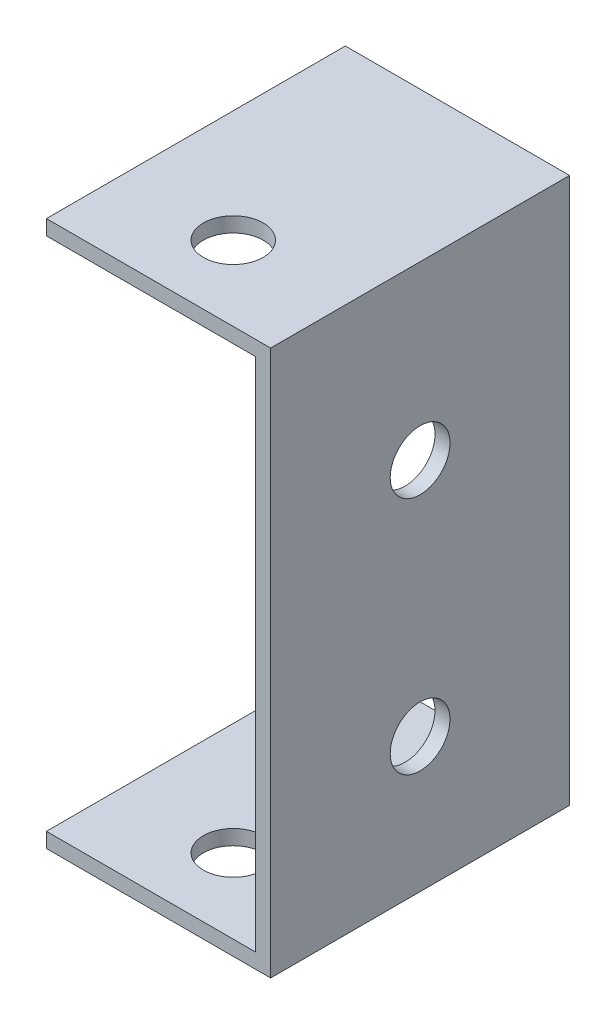
ISO-10303-21;
HEADER;
FILE_DESCRIPTION(('STEP AP214'),'2;1');
FILE_NAME('part.step','',(''),(''),'','','');
FILE_SCHEMA(('AUTOMOTIVE_DESIGN { 1 0 10303 214 1 1 1 1 }'));
ENDSEC;
DATA;
#1=APPLICATION_CONTEXT('core data for automotive mechanical design processes');
#2=APPLICATION_PROTOCOL_DEFINITION('international standard','automotive_design',2000,#1);
#3=PRODUCT_CONTEXT('',#1,'mechanical');
#4=PRODUCT('Part','Part','',(#3));
#5=PRODUCT_RELATED_PRODUCT_CATEGORY('part','',(#4));
#6=PRODUCT_DEFINITION_FORMATION('','',#4);
#7=PRODUCT_DEFINITION_CONTEXT('part definition',#1,'design');
#8=PRODUCT_DEFINITION('design','',#6,#7);
#9=PRODUCT_DEFINITION_SHAPE('','',#8);
#10=(LENGTH_UNIT() NAMED_UNIT(*) SI_UNIT(.MILLI.,.METRE.));
#11=(NAMED_UNIT(*) PLANE_ANGLE_UNIT() SI_UNIT($,.RADIAN.));
#12=(NAMED_UNIT(*) SI_UNIT($,.STERADIAN.) SOLID_ANGLE_UNIT());
#13=UNCERTAINTY_MEASURE_WITH_UNIT(LENGTH_MEASURE(1.E-05),#10,'distance_accuracy_value','');
#14=(GEOMETRIC_REPRESENTATION_CONTEXT(3) GLOBAL_UNCERTAINTY_ASSIGNED_CONTEXT((#13)) GLOBAL_UNIT_ASSIGNED_CONTEXT((#10,
#11,#12)) REPRESENTATION_CONTEXT('',''));
#15=CARTESIAN_POINT('',(0.,0.,0.));
#16=DIRECTION('',(0.,0.,1.));
#17=DIRECTION('',(1.,0.,0.));
#18=AXIS2_PLACEMENT_3D('',#15,#16,#17);
#19=CARTESIAN_POINT('',(-61.1657608940353,44.9950245879445,40.));
#20=DIRECTION('',(1.,0.,0.));
#21=DIRECTION('',(0.,0.,-1.));
#22=AXIS2_PLACEMENT_3D('',#19,#20,#21);
#23=PLANE('',#22);
#24=DIRECTION('',(0.,-1.,0.));
#25=VECTOR('',#24,1.);
#26=CARTESIAN_POINT('',(-61.1657608940353,44.9950245879445,0.));
#27=LINE('',#26,#25);
#28=CARTESIAN_POINT('',(-61.1657608940353,46.9950245879445,0.));
#29=VERTEX_POINT('',#28);
#30=CARTESIAN_POINT('',(-61.1657608940353,44.9950245879445,0.));
#31=VERTEX_POINT('',#30);
#32=EDGE_CURVE('E145',#29,#31,#27,.T.);
#33=ORIENTED_EDGE('',*,*,#32,.T.);
#34=DIRECTION('',(0.,0.,-1.));
#35=VECTOR('',#34,1.);
#36=CARTESIAN_POINT('',(-61.1657608940353,44.9950245879445,40.));
#37=LINE('',#36,#35);
#38=CARTESIAN_POINT('',(-61.1657608940353,44.9950245879445,40.));
#39=VERTEX_POINT('',#38);
#40=EDGE_CURVE('E13',#39,#31,#37,.T.);
#41=ORIENTED_EDGE('',*,*,#40,.F.);
#42=DIRECTION('',(0.,-1.,0.));
#43=VECTOR('',#42,1.);
#44=CARTESIAN_POINT('',(-61.1657608940353,44.9950245879445,40.));
#45=LINE('',#44,#43);
#46=CARTESIAN_POINT('',(-61.1657608940353,46.9950245879445,40.));
#47=VERTEX_POINT('',#46);
#48=EDGE_CURVE('E159',#47,#39,#45,.T.);
#49=ORIENTED_EDGE('',*,*,#48,.F.);
#50=DIRECTION('',(0.,0.,-1.));
#51=VECTOR('',#50,1.);
#52=CARTESIAN_POINT('',(-61.1657608940353,46.9950245879445,40.));
#53=LINE('',#52,#51);
#54=EDGE_CURVE('E141',#47,#29,#53,.T.);
#55=ORIENTED_EDGE('',*,*,#54,.T.);
#56=EDGE_LOOP('',(#33,#41,#49,#55));
#57=FACE_BOUND('',#56,.T.);
#58=ADVANCED_FACE('F47',(#57),#23,.F.);
#59=CARTESIAN_POINT('',(-33.1657608940353,44.9950245879445,40.));
#60=DIRECTION('',(0.,1.,0.));
#61=DIRECTION('',(0.,0.,1.));
#62=AXIS2_PLACEMENT_3D('',#59,#60,#61);
#63=PLANE('',#62);
#64=CARTESIAN_POINT('',(-46.1657608940353,44.9950245879445,30.));
#65=DIRECTION('',(0.,1.,0.));
#66=DIRECTION('',(0.,0.,1.));
#67=AXIS2_PLACEMENT_3D('',#64,#65,#66);
#68=CIRCLE('',#67,4.);
#69=CARTESIAN_POINT('',(-46.1657608940353,44.9950245879445,34.));
#70=VERTEX_POINT('',#69);
#71=EDGE_CURVE('E182',#70,#70,#68,.T.);
#72=ORIENTED_EDGE('',*,*,#71,.T.);
#73=EDGE_LOOP('',(#72));
#74=FACE_BOUND('',#73,.T.);
#75=DIRECTION('',(1.,0.,0.));
#76=VECTOR('',#75,1.);
#77=CARTESIAN_POINT('',(-33.1657608940353,44.9950245879445,0.));
#78=LINE('',#77,#76);
#79=CARTESIAN_POINT('',(-33.1657608940353,44.9950245879445,0.));
#80=VERTEX_POINT('',#79);
#81=EDGE_CURVE('E148',#31,#80,#78,.T.);
#82=ORIENTED_EDGE('',*,*,#81,.T.);
#83=DIRECTION('',(0.,0.,-1.));
#84=VECTOR('',#83,1.);
#85=CARTESIAN_POINT('',(-33.1657608940353,44.9950245879445,40.));
#86=LINE('',#85,#84);
#87=CARTESIAN_POINT('',(-33.1657608940353,44.9950245879445,40.));
#88=VERTEX_POINT('',#87);
#89=EDGE_CURVE('E56',#88,#80,#86,.T.);
#90=ORIENTED_EDGE('',*,*,#89,.F.);
#91=DIRECTION('',(1.,0.,0.));
#92=VECTOR('',#91,1.);
#93=CARTESIAN_POINT('',(-33.1657608940353,44.9950245879445,40.));
#94=LINE('',#93,#92);
#95=EDGE_CURVE('E108',#39,#88,#94,.T.);
#96=ORIENTED_EDGE('',*,*,#95,.F.);
#97=ORIENTED_EDGE('',*,*,#40,.T.);
#98=EDGE_LOOP('',(#82,#90,#96,#97));
#99=FACE_BOUND('',#98,.T.);
#100=ADVANCED_FACE('F223',(#74,#99),#63,.F.);
#101=CARTESIAN_POINT('',(-33.1657608940353,-24.0049754120555,40.));
#102=DIRECTION('',(1.,0.,0.));
#103=DIRECTION('',(0.,0.,-1.));
#104=AXIS2_PLACEMENT_3D('',#101,#102,#103);
#105=PLANE('',#104);
#106=CARTESIAN_POINT('',(-33.1657608940353,23.9950245879445,20.));
#107=DIRECTION('',(-1.,0.,0.));
#108=DIRECTION('',(0.,0.,1.));
#109=AXIS2_PLACEMENT_3D('',#106,#107,#108);
#110=CIRCLE('',#109,4.);
#111=CARTESIAN_POINT('',(-33.1657608940353,23.9950245879445,24.));
#112=VERTEX_POINT('',#111);
#113=EDGE_CURVE('E172',#112,#112,#110,.T.);
#114=ORIENTED_EDGE('',*,*,#113,.F.);
#115=EDGE_LOOP('',(#114));
#116=FACE_BOUND('',#115,.T.);
#117=CARTESIAN_POINT('',(-33.1657608940353,-8.00497541205545,20.));
#118=DIRECTION('',(-1.,0.,0.));
#119=DIRECTION('',(0.,0.,1.));
#120=AXIS2_PLACEMENT_3D('',#117,#118,#119);
#121=CIRCLE('',#120,4.);
#122=CARTESIAN_POINT('',(-33.1657608940353,-8.00497541205545,24.));
#123=VERTEX_POINT('',#122);
#124=EDGE_CURVE('E177',#123,#123,#121,.T.);
#125=ORIENTED_EDGE('',*,*,#124,.F.);
#126=EDGE_LOOP('',(#125));
#127=FACE_BOUND('',#126,.T.);
#128=DIRECTION('',(0.,-1.,0.));
#129=VECTOR('',#128,1.);
#130=CARTESIAN_POINT('',(-33.1657608940353,-24.0049754120555,0.));
#131=LINE('',#130,#129);
#132=CARTESIAN_POINT('',(-33.1657608940353,-24.0049754120555,0.));
#133=VERTEX_POINT('',#132);
#134=EDGE_CURVE('E150',#80,#133,#131,.T.);
#135=ORIENTED_EDGE('',*,*,#134,.T.);
#136=DIRECTION('',(0.,0.,-1.));
#137=VECTOR('',#136,1.);
#138=CARTESIAN_POINT('',(-33.1657608940353,-24.0049754120555,40.));
#139=LINE('',#138,#137);
#140=CARTESIAN_POINT('',(-33.1657608940353,-24.0049754120555,40.));
#141=VERTEX_POINT('',#140);
#142=EDGE_CURVE('E166',#141,#133,#139,.T.);
#143=ORIENTED_EDGE('',*,*,#142,.F.);
#144=DIRECTION('',(0.,-1.,0.));
#145=VECTOR('',#144,1.);
#146=CARTESIAN_POINT('',(-33.1657608940353,-24.0049754120555,40.));
#147=LINE('',#146,#145);
#148=EDGE_CURVE('E189',#88,#141,#147,.T.);
#149=ORIENTED_EDGE('',*,*,#148,.F.);
#150=ORIENTED_EDGE('',*,*,#89,.T.);
#151=EDGE_LOOP('',(#135,#143,#149,#150));
#152=FACE_BOUND('',#151,.T.);
#153=ADVANCED_FACE('F227',(#116,#127,#152),#105,.F.);
#154=CARTESIAN_POINT('',(-61.1657608940353,-24.0049754120555,40.));
#155=DIRECTION('',(0.,-1.,0.));
#156=DIRECTION('',(0.,0.,-1.));
#157=AXIS2_PLACEMENT_3D('',#154,#155,#156);
#158=PLANE('',#157);
#159=CARTESIAN_POINT('',(-46.1657608940353,-24.0049754120555,30.));
#160=DIRECTION('',(0.,-1.,0.));
#161=DIRECTION('',(0.,0.,-1.));
#162=AXIS2_PLACEMENT_3D('',#159,#160,#161);
#163=CIRCLE('',#162,4.);
#164=CARTESIAN_POINT('',(-46.1657608940353,-24.0049754120555,26.));
#165=VERTEX_POINT('',#164);
#166=EDGE_CURVE('E249',#165,#165,#163,.T.);
#167=ORIENTED_EDGE('',*,*,#166,.T.);
#168=EDGE_LOOP('',(#167));
#169=FACE_BOUND('',#168,.T.);
#170=DIRECTION('',(-1.,0.,0.));
#171=VECTOR('',#170,1.);
#172=CARTESIAN_POINT('',(-61.1657608940353,-24.0049754120555,0.));
#173=LINE('',#172,#171);
#174=CARTESIAN_POINT('',(-61.1657608940353,-24.0049754120555,0.));
#175=VERTEX_POINT('',#174);
#176=EDGE_CURVE('E152',#133,#175,#173,.T.);
#177=ORIENTED_EDGE('',*,*,#176,.T.);
#178=DIRECTION('',(0.,0.,-1.));
#179=VECTOR('',#178,1.);
#180=CARTESIAN_POINT('',(-61.1657608940353,-24.0049754120555,40.));
#181=LINE('',#180,#179);
#182=CARTESIAN_POINT('',(-61.1657608940353,-24.0049754120555,40.));
#183=VERTEX_POINT('',#182);
#184=EDGE_CURVE('E163',#183,#175,#181,.T.);
#185=ORIENTED_EDGE('',*,*,#184,.F.);
#186=DIRECTION('',(-1.,0.,0.));
#187=VECTOR('',#186,1.);
#188=CARTESIAN_POINT('',(-61.1657608940353,-24.0049754120555,40.));
#189=LINE('',#188,#187);
#190=EDGE_CURVE('E191',#141,#183,#189,.T.);
#191=ORIENTED_EDGE('',*,*,#190,.F.);
#192=ORIENTED_EDGE('',*,*,#142,.T.);
#193=EDGE_LOOP('',(#177,#185,#191,#192));
#194=FACE_BOUND('',#193,.T.);
#195=ADVANCED_FACE('F197',(#169,#194),#158,.F.);
#196=CARTESIAN_POINT('',(-61.1657608940353,-26.0049754120555,40.));
#197=DIRECTION('',(1.,0.,0.));
#198=DIRECTION('',(0.,0.,-1.));
#199=AXIS2_PLACEMENT_3D('',#196,#197,#198);
#200=PLANE('',#199);
#201=DIRECTION('',(0.,-1.,0.));
#202=VECTOR('',#201,1.);
#203=CARTESIAN_POINT('',(-61.1657608940353,-26.0049754120555,0.));
#204=LINE('',#203,#202);
#205=CARTESIAN_POINT('',(-61.1657608940353,-26.0049754120555,0.));
#206=VERTEX_POINT('',#205);
#207=EDGE_CURVE('E154',#175,#206,#204,.T.);
#208=ORIENTED_EDGE('',*,*,#207,.T.);
#209=DIRECTION('',(0.,0.,-1.));
#210=VECTOR('',#209,1.);
#211=CARTESIAN_POINT('',(-61.1657608940353,-26.0049754120555,40.));
#212=LINE('',#211,#210);
#213=CARTESIAN_POINT('',(-61.1657608940353,-26.0049754120555,40.));
#214=VERTEX_POINT('',#213);
#215=EDGE_CURVE('E136',#214,#206,#212,.T.);
#216=ORIENTED_EDGE('',*,*,#215,.F.);
#217=DIRECTION('',(0.,-1.,0.));
#218=VECTOR('',#217,1.);
#219=CARTESIAN_POINT('',(-61.1657608940353,-26.0049754120555,40.));
#220=LINE('',#219,#218);
#221=EDGE_CURVE('E127',#183,#214,#220,.T.);
#222=ORIENTED_EDGE('',*,*,#221,.F.);
#223=ORIENTED_EDGE('',*,*,#184,.T.);
#224=EDGE_LOOP('',(#208,#216,#222,#223));
#225=FACE_BOUND('',#224,.T.);
#226=ADVANCED_FACE('F201',(#225),#200,.F.);
#227=CARTESIAN_POINT('',(-31.1657608940353,-26.0049754120555,40.));
#228=DIRECTION('',(0.,1.,0.));
#229=DIRECTION('',(0.,0.,1.));
#230=AXIS2_PLACEMENT_3D('',#227,#228,#229);
#231=PLANE('',#230);
#232=CARTESIAN_POINT('',(-46.1657608940353,-26.0049754120555,30.));
#233=DIRECTION('',(0.,1.,0.));
#234=DIRECTION('',(0.,0.,1.));
#235=AXIS2_PLACEMENT_3D('',#232,#233,#234);
#236=CIRCLE('',#235,4.);
#237=CARTESIAN_POINT('',(-46.1657608940353,-26.0049754120555,34.));
#238=VERTEX_POINT('',#237);
#239=EDGE_CURVE('E247',#238,#238,#236,.T.);
#240=ORIENTED_EDGE('',*,*,#239,.T.);
#241=EDGE_LOOP('',(#240));
#242=FACE_BOUND('',#241,.T.);
#243=DIRECTION('',(1.,0.,0.));
#244=VECTOR('',#243,1.);
#245=CARTESIAN_POINT('',(-31.1657608940353,-26.0049754120555,0.));
#246=LINE('',#245,#244);
#247=CARTESIAN_POINT('',(-31.1657608940353,-26.0049754120555,0.));
#248=VERTEX_POINT('',#247);
#249=EDGE_CURVE('E135',#206,#248,#246,.T.);
#250=ORIENTED_EDGE('',*,*,#249,.T.);
#251=DIRECTION('',(0.,0.,-1.));
#252=VECTOR('',#251,1.);
#253=CARTESIAN_POINT('',(-31.1657608940353,-26.0049754120555,40.));
#254=LINE('',#253,#252);
#255=CARTESIAN_POINT('',(-31.1657608940353,-26.0049754120555,40.));
#256=VERTEX_POINT('',#255);
#257=EDGE_CURVE('E132',#256,#248,#254,.T.);
#258=ORIENTED_EDGE('',*,*,#257,.F.);
#259=DIRECTION('',(1.,0.,0.));
#260=VECTOR('',#259,1.);
#261=CARTESIAN_POINT('',(-31.1657608940353,-26.0049754120555,40.));
#262=LINE('',#261,#260);
#263=EDGE_CURVE('E121',#214,#256,#262,.T.);
#264=ORIENTED_EDGE('',*,*,#263,.F.);
#265=ORIENTED_EDGE('',*,*,#215,.T.);
#266=EDGE_LOOP('',(#250,#258,#264,#265));
#267=FACE_BOUND('',#266,.T.);
#268=ADVANCED_FACE('F133',(#242,#267),#231,.F.);
#269=CARTESIAN_POINT('',(-31.1657608940353,46.9950245879445,40.));
#270=DIRECTION('',(-1.,0.,0.));
#271=DIRECTION('',(0.,-1.,0.));
#272=AXIS2_PLACEMENT_3D('',#269,#270,#271);
#273=PLANE('',#272);
#274=CARTESIAN_POINT('',(-31.1657608940353,23.9950245879445,20.));
#275=DIRECTION('',(-1.,0.,0.));
#276=DIRECTION('',(0.,-1.,0.));
#277=AXIS2_PLACEMENT_3D('',#274,#275,#276);
#278=CIRCLE('',#277,4.);
#279=CARTESIAN_POINT('',(-31.1657608940353,19.9950245879445,20.));
#280=VERTEX_POINT('',#279);
#281=EDGE_CURVE('E50',#280,#280,#278,.T.);
#282=ORIENTED_EDGE('',*,*,#281,.T.);
#283=EDGE_LOOP('',(#282));
#284=FACE_BOUND('',#283,.T.);
#285=CARTESIAN_POINT('',(-31.1657608940353,-8.00497541205545,20.));
#286=DIRECTION('',(-1.,0.,0.));
#287=DIRECTION('',(0.,-1.,0.));
#288=AXIS2_PLACEMENT_3D('',#285,#286,#287);
#289=CIRCLE('',#288,4.);
#290=CARTESIAN_POINT('',(-31.1657608940353,-12.0049754120555,20.));
#291=VERTEX_POINT('',#290);
#292=EDGE_CURVE('E170',#291,#291,#289,.T.);
#293=ORIENTED_EDGE('',*,*,#292,.T.);
#294=EDGE_LOOP('',(#293));
#295=FACE_BOUND('',#294,.T.);
#296=DIRECTION('',(0.,1.,0.));
#297=VECTOR('',#296,1.);
#298=CARTESIAN_POINT('',(-31.1657608940353,46.9950245879445,0.));
#299=LINE('',#298,#297);
#300=CARTESIAN_POINT('',(-31.1657608940353,46.9950245879445,0.));
#301=VERTEX_POINT('',#300);
#302=EDGE_CURVE('E94',#248,#301,#299,.T.);
#303=ORIENTED_EDGE('',*,*,#302,.T.);
#304=DIRECTION('',(0.,0.,-1.));
#305=VECTOR('',#304,1.);
#306=CARTESIAN_POINT('',(-31.1657608940353,46.9950245879445,40.));
#307=LINE('',#306,#305);
#308=CARTESIAN_POINT('',(-31.1657608940353,46.9950245879445,40.));
#309=VERTEX_POINT('',#308);
#310=EDGE_CURVE('E137',#309,#301,#307,.T.);
#311=ORIENTED_EDGE('',*,*,#310,.F.);
#312=DIRECTION('',(0.,1.,0.));
#313=VECTOR('',#312,1.);
#314=CARTESIAN_POINT('',(-31.1657608940353,46.9950245879445,40.));
#315=LINE('',#314,#313);
#316=EDGE_CURVE('E125',#256,#309,#315,.T.);
#317=ORIENTED_EDGE('',*,*,#316,.F.);
#318=ORIENTED_EDGE('',*,*,#257,.T.);
#319=EDGE_LOOP('',(#303,#311,#317,#318));
#320=FACE_BOUND('',#319,.T.);
#321=ADVANCED_FACE('F139',(#284,#295,#320),#273,.F.);
#322=CARTESIAN_POINT('',(-61.1657608940353,46.9950245879445,40.));
#323=DIRECTION('',(0.,-1.,0.));
#324=DIRECTION('',(0.,0.,-1.));
#325=AXIS2_PLACEMENT_3D('',#322,#323,#324);
#326=PLANE('',#325);
#327=CARTESIAN_POINT('',(-46.1657608940353,46.9950245879445,30.));
#328=DIRECTION('',(0.,1.,0.));
#329=DIRECTION('',(0.,0.,1.));
#330=AXIS2_PLACEMENT_3D('',#327,#328,#329);
#331=CIRCLE('',#330,4.);
#332=CARTESIAN_POINT('',(-46.1657608940353,46.9950245879445,34.));
#333=VERTEX_POINT('',#332);
#334=EDGE_CURVE('E250',#333,#333,#331,.T.);
#335=ORIENTED_EDGE('',*,*,#334,.F.);
#336=EDGE_LOOP('',(#335));
#337=FACE_BOUND('',#336,.T.);
#338=DIRECTION('',(-1.,0.,0.));
#339=VECTOR('',#338,1.);
#340=CARTESIAN_POINT('',(-61.1657608940353,46.9950245879445,0.));
#341=LINE('',#340,#339);
#342=EDGE_CURVE('E100',#301,#29,#341,.T.);
#343=ORIENTED_EDGE('',*,*,#342,.T.);
#344=ORIENTED_EDGE('',*,*,#54,.F.);
#345=DIRECTION('',(-1.,0.,0.));
#346=VECTOR('',#345,1.);
#347=CARTESIAN_POINT('',(-61.1657608940353,46.9950245879445,40.));
#348=LINE('',#347,#346);
#349=EDGE_CURVE('E65',#309,#47,#348,.T.);
#350=ORIENTED_EDGE('',*,*,#349,.F.);
#351=ORIENTED_EDGE('',*,*,#310,.T.);
#352=EDGE_LOOP('',(#343,#344,#350,#351));
#353=FACE_BOUND('',#352,.T.);
#354=ADVANCED_FACE('F209',(#337,#353),#326,.F.);
#355=CARTESIAN_POINT('',(0.,0.,40.));
#356=DIRECTION('',(0.,0.,-1.));
#357=DIRECTION('',(-1.,0.,0.));
#358=AXIS2_PLACEMENT_3D('',#355,#356,#357);
#359=PLANE('',#358);
#360=ORIENTED_EDGE('',*,*,#48,.T.);
#361=ORIENTED_EDGE('',*,*,#95,.T.);
#362=ORIENTED_EDGE('',*,*,#148,.T.);
#363=ORIENTED_EDGE('',*,*,#190,.T.);
#364=ORIENTED_EDGE('',*,*,#221,.T.);
#365=ORIENTED_EDGE('',*,*,#263,.T.);
#366=ORIENTED_EDGE('',*,*,#316,.T.);
#367=ORIENTED_EDGE('',*,*,#349,.T.);
#368=EDGE_LOOP('',(#360,#361,#362,#363,#364,#365,#366,#367));
#369=FACE_BOUND('',#368,.T.);
#370=ADVANCED_FACE('F123',(#369),#359,.F.);
#371=CARTESIAN_POINT('',(0.,0.,0.));
#372=DIRECTION('',(0.,0.,-1.));
#373=DIRECTION('',(-1.,0.,0.));
#374=AXIS2_PLACEMENT_3D('',#371,#372,#373);
#375=PLANE('',#374);
#376=ORIENTED_EDGE('',*,*,#32,.F.);
#377=ORIENTED_EDGE('',*,*,#342,.F.);
#378=ORIENTED_EDGE('',*,*,#302,.F.);
#379=ORIENTED_EDGE('',*,*,#249,.F.);
#380=ORIENTED_EDGE('',*,*,#207,.F.);
#381=ORIENTED_EDGE('',*,*,#176,.F.);
#382=ORIENTED_EDGE('',*,*,#134,.F.);
#383=ORIENTED_EDGE('',*,*,#81,.F.);
#384=EDGE_LOOP('',(#376,#377,#378,#379,#380,#381,#382,#383));
#385=FACE_BOUND('',#384,.T.);
#386=ADVANCED_FACE('F204',(#385),#375,.T.);
#387=CARTESIAN_POINT('',(6.83423910596467,-8.00497541205545,20.));
#388=DIRECTION('',(-1.,0.,0.));
#389=DIRECTION('',(0.,0.,1.));
#390=AXIS2_PLACEMENT_3D('',#387,#388,#389);
#391=CYLINDRICAL_SURFACE('',#390,4.);
#392=ORIENTED_EDGE('',*,*,#124,.T.);
#393=EDGE_LOOP('',(#392));
#394=FACE_BOUND('',#393,.T.);
#395=ORIENTED_EDGE('',*,*,#292,.F.);
#396=EDGE_LOOP('',(#395));
#397=FACE_BOUND('',#396,.T.);
#398=ADVANCED_FACE('F267',(#394,#397),#391,.F.);
#399=CARTESIAN_POINT('',(6.83423910596467,23.9950245879445,20.));
#400=DIRECTION('',(-1.,0.,0.));
#401=DIRECTION('',(0.,0.,1.));
#402=AXIS2_PLACEMENT_3D('',#399,#400,#401);
#403=CYLINDRICAL_SURFACE('',#402,4.);
#404=ORIENTED_EDGE('',*,*,#113,.T.);
#405=EDGE_LOOP('',(#404));
#406=FACE_BOUND('',#405,.T.);
#407=ORIENTED_EDGE('',*,*,#281,.F.);
#408=EDGE_LOOP('',(#407));
#409=FACE_BOUND('',#408,.T.);
#410=ADVANCED_FACE('F260',(#406,#409),#403,.F.);
#411=CARTESIAN_POINT('',(-46.1657608940353,-49.0049754120555,30.));
#412=DIRECTION('',(0.,1.,0.));
#413=DIRECTION('',(0.,0.,1.));
#414=AXIS2_PLACEMENT_3D('',#411,#412,#413);
#415=CYLINDRICAL_SURFACE('',#414,4.);
#416=ORIENTED_EDGE('',*,*,#334,.T.);
#417=EDGE_LOOP('',(#416));
#418=FACE_BOUND('',#417,.T.);
#419=ORIENTED_EDGE('',*,*,#71,.F.);
#420=EDGE_LOOP('',(#419));
#421=FACE_BOUND('',#420,.T.);
#422=ADVANCED_FACE('F256',(#418,#421),#415,.F.);
#423=ORIENTED_EDGE('',*,*,#239,.F.);
#424=EDGE_LOOP('',(#423));
#425=FACE_BOUND('',#424,.T.);
#426=ORIENTED_EDGE('',*,*,#166,.F.);
#427=EDGE_LOOP('',(#426));
#428=FACE_BOUND('',#427,.T.);
#429=ADVANCED_FACE('F259',(#425,#428),#415,.F.);
#430=CLOSED_SHELL('',(#58,#100,#153,#195,#226,#268,#321,#354,#370,#386,#398,#410,#422,#429));
#431=MANIFOLD_SOLID_BREP('B2',#430);
#432=ADVANCED_BREP_SHAPE_REPRESENTATION('',(#18,#431),#14);
#433=SHAPE_DEFINITION_REPRESENTATION(#9,#432);
ENDSEC;
END-ISO-10303-21;
